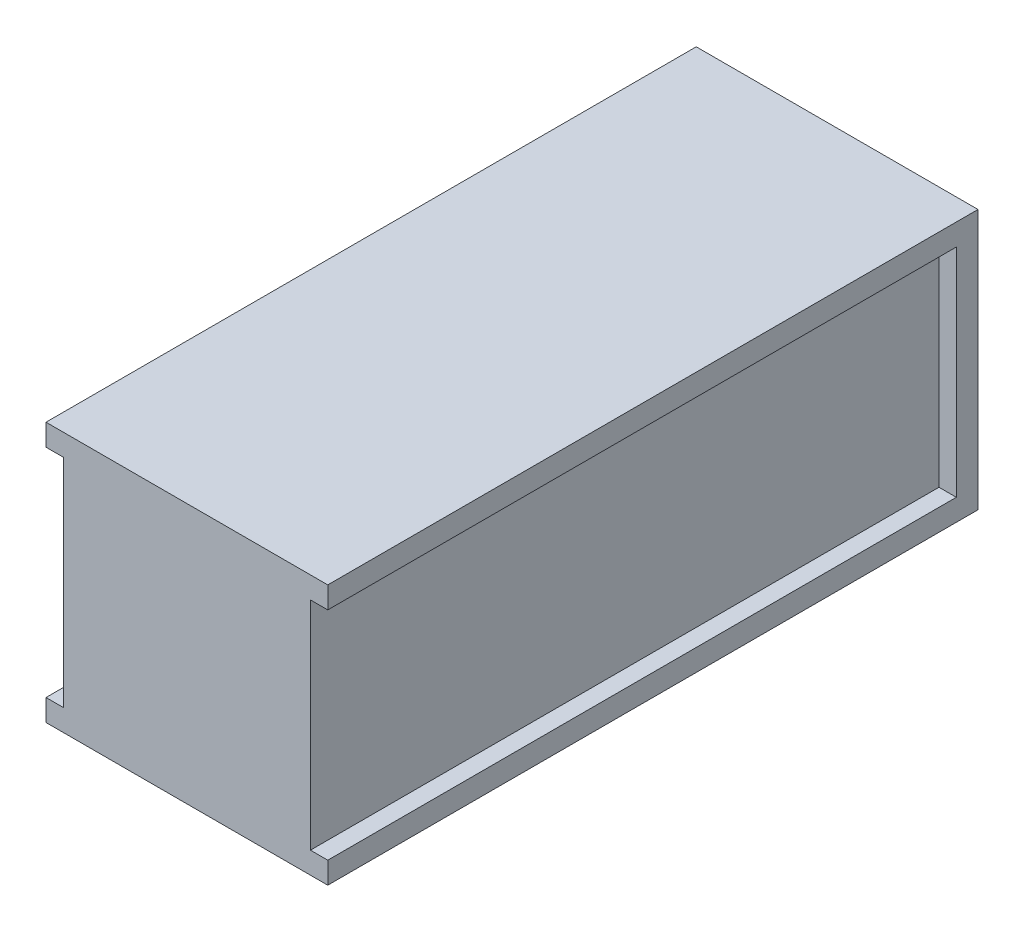
ISO-10303-21;
HEADER;
FILE_DESCRIPTION(('STEP AP214'),'2;1');
FILE_NAME('part.step','',(''),(''),'','','');
FILE_SCHEMA(('AUTOMOTIVE_DESIGN { 1 0 10303 214 1 1 1 1 }'));
ENDSEC;
DATA;
#1=APPLICATION_CONTEXT('core data for automotive mechanical design processes');
#2=APPLICATION_PROTOCOL_DEFINITION('international standard','automotive_design',2000,#1);
#3=PRODUCT_CONTEXT('',#1,'mechanical');
#4=PRODUCT('Part','Part','',(#3));
#5=PRODUCT_RELATED_PRODUCT_CATEGORY('part','',(#4));
#6=PRODUCT_DEFINITION_FORMATION('','',#4);
#7=PRODUCT_DEFINITION_CONTEXT('part definition',#1,'design');
#8=PRODUCT_DEFINITION('design','',#6,#7);
#9=PRODUCT_DEFINITION_SHAPE('','',#8);
#10=(LENGTH_UNIT() NAMED_UNIT(*) SI_UNIT(.MILLI.,.METRE.));
#11=(NAMED_UNIT(*) PLANE_ANGLE_UNIT() SI_UNIT($,.RADIAN.));
#12=(NAMED_UNIT(*) SI_UNIT($,.STERADIAN.) SOLID_ANGLE_UNIT());
#13=UNCERTAINTY_MEASURE_WITH_UNIT(LENGTH_MEASURE(1.E-05),#10,'distance_accuracy_value','');
#14=(GEOMETRIC_REPRESENTATION_CONTEXT(3) GLOBAL_UNCERTAINTY_ASSIGNED_CONTEXT((#13)) GLOBAL_UNIT_ASSIGNED_CONTEXT((#10,
#11,#12)) REPRESENTATION_CONTEXT('',''));
#15=CARTESIAN_POINT('',(0.,0.,0.));
#16=DIRECTION('',(0.,0.,1.));
#17=DIRECTION('',(1.,0.,0.));
#18=AXIS2_PLACEMENT_3D('',#15,#16,#17);
#19=CARTESIAN_POINT('',(-32.5,60.,75.));
#20=DIRECTION('',(0.,0.,-1.));
#21=DIRECTION('',(-1.,0.,0.));
#22=AXIS2_PLACEMENT_3D('',#19,#20,#21);
#23=PLANE('',#22);
#24=DIRECTION('',(1.,0.,0.));
#25=VECTOR('',#24,1.);
#26=CARTESIAN_POINT('',(28.5,55.,75.));
#27=LINE('',#26,#25);
#28=CARTESIAN_POINT('',(28.5,55.,75.));
#29=VERTEX_POINT('',#28);
#30=CARTESIAN_POINT('',(32.5,55.,75.));
#31=VERTEX_POINT('',#30);
#32=EDGE_CURVE('E163',#29,#31,#27,.T.);
#33=ORIENTED_EDGE('',*,*,#32,.T.);
#34=DIRECTION('',(0.,-1.,0.));
#35=VECTOR('',#34,1.);
#36=CARTESIAN_POINT('',(32.5,60.,75.));
#37=LINE('',#36,#35);
#38=CARTESIAN_POINT('',(32.5,60.,75.));
#39=VERTEX_POINT('',#38);
#40=EDGE_CURVE('E198',#39,#31,#37,.T.);
#41=ORIENTED_EDGE('',*,*,#40,.F.);
#42=DIRECTION('',(1.,0.,0.));
#43=VECTOR('',#42,1.);
#44=CARTESIAN_POINT('',(-32.5,60.,75.));
#45=LINE('',#44,#43);
#46=CARTESIAN_POINT('',(-32.5,60.,75.));
#47=VERTEX_POINT('',#46);
#48=EDGE_CURVE('E179',#47,#39,#45,.T.);
#49=ORIENTED_EDGE('',*,*,#48,.F.);
#50=DIRECTION('',(0.,-1.,0.));
#51=VECTOR('',#50,1.);
#52=CARTESIAN_POINT('',(-32.5,60.,75.));
#53=LINE('',#52,#51);
#54=CARTESIAN_POINT('',(-32.5,55.,75.));
#55=VERTEX_POINT('',#54);
#56=EDGE_CURVE('E11',#47,#55,#53,.T.);
#57=ORIENTED_EDGE('',*,*,#56,.T.);
#58=DIRECTION('',(-1.,0.,0.));
#59=VECTOR('',#58,1.);
#60=CARTESIAN_POINT('',(-28.5,55.,75.));
#61=LINE('',#60,#59);
#62=CARTESIAN_POINT('',(-28.5,55.,75.));
#63=VERTEX_POINT('',#62);
#64=EDGE_CURVE('E158',#63,#55,#61,.T.);
#65=ORIENTED_EDGE('',*,*,#64,.F.);
#66=DIRECTION('',(0.,1.,0.));
#67=VECTOR('',#66,1.);
#68=CARTESIAN_POINT('',(-28.5,55.,75.));
#69=LINE('',#68,#67);
#70=CARTESIAN_POINT('',(-28.5,4.99999999999999,75.));
#71=VERTEX_POINT('',#70);
#72=EDGE_CURVE('E149',#71,#63,#69,.T.);
#73=ORIENTED_EDGE('',*,*,#72,.F.);
#74=DIRECTION('',(-1.,0.,0.));
#75=VECTOR('',#74,1.);
#76=CARTESIAN_POINT('',(-28.5,5.00000000000002,75.));
#77=LINE('',#76,#75);
#78=CARTESIAN_POINT('',(-32.5,5.00000000000002,75.));
#79=VERTEX_POINT('',#78);
#80=EDGE_CURVE('E167',#71,#79,#77,.T.);
#81=ORIENTED_EDGE('',*,*,#80,.T.);
#82=CARTESIAN_POINT('',(-32.5,0.,75.));
#83=VERTEX_POINT('',#82);
#84=EDGE_CURVE('E40',#79,#83,#53,.T.);
#85=ORIENTED_EDGE('',*,*,#84,.T.);
#86=DIRECTION('',(1.,0.,0.));
#87=VECTOR('',#86,1.);
#88=CARTESIAN_POINT('',(-32.5,0.,75.));
#89=LINE('',#88,#87);
#90=CARTESIAN_POINT('',(32.5,0.,75.));
#91=VERTEX_POINT('',#90);
#92=EDGE_CURVE('E189',#83,#91,#89,.T.);
#93=ORIENTED_EDGE('',*,*,#92,.T.);
#94=CARTESIAN_POINT('',(32.5,5.,75.));
#95=VERTEX_POINT('',#94);
#96=EDGE_CURVE('E142',#95,#91,#37,.T.);
#97=ORIENTED_EDGE('',*,*,#96,.F.);
#98=DIRECTION('',(1.,0.,0.));
#99=VECTOR('',#98,1.);
#100=CARTESIAN_POINT('',(28.5,5.00000000000002,75.));
#101=LINE('',#100,#99);
#102=CARTESIAN_POINT('',(28.5,5.00000000000002,75.));
#103=VERTEX_POINT('',#102);
#104=EDGE_CURVE('E47',#103,#95,#101,.T.);
#105=ORIENTED_EDGE('',*,*,#104,.F.);
#106=DIRECTION('',(0.,1.,0.));
#107=VECTOR('',#106,1.);
#108=CARTESIAN_POINT('',(28.5,55.,75.));
#109=LINE('',#108,#107);
#110=EDGE_CURVE('E130',#103,#29,#109,.T.);
#111=ORIENTED_EDGE('',*,*,#110,.T.);
#112=EDGE_LOOP('',(#33,#41,#49,#57,#65,#73,#81,#85,#93,#97,#105,#111));
#113=FACE_BOUND('',#112,.T.);
#114=ADVANCED_FACE('F32',(#113),#23,.F.);
#115=CARTESIAN_POINT('',(32.5,60.,-75.));
#116=DIRECTION('',(-1.,0.,0.));
#117=DIRECTION('',(0.,0.,1.));
#118=AXIS2_PLACEMENT_3D('',#115,#116,#117);
#119=PLANE('',#118);
#120=DIRECTION('',(0.,0.,-1.));
#121=VECTOR('',#120,1.);
#122=CARTESIAN_POINT('',(32.5,55.,75.));
#123=LINE('',#122,#121);
#124=CARTESIAN_POINT('',(32.5,55.,-70.));
#125=VERTEX_POINT('',#124);
#126=EDGE_CURVE('E138',#31,#125,#123,.T.);
#127=ORIENTED_EDGE('',*,*,#126,.T.);
#128=DIRECTION('',(0.,-1.,0.));
#129=VECTOR('',#128,1.);
#130=CARTESIAN_POINT('',(32.5,55.,-70.));
#131=LINE('',#130,#129);
#132=CARTESIAN_POINT('',(32.5,4.99999999999999,-70.));
#133=VERTEX_POINT('',#132);
#134=EDGE_CURVE('E229',#125,#133,#131,.T.);
#135=ORIENTED_EDGE('',*,*,#134,.T.);
#136=DIRECTION('',(0.,0.,1.));
#137=VECTOR('',#136,1.);
#138=CARTESIAN_POINT('',(32.5,5.00000000000002,75.));
#139=LINE('',#138,#137);
#140=EDGE_CURVE('E208',#133,#95,#139,.T.);
#141=ORIENTED_EDGE('',*,*,#140,.T.);
#142=ORIENTED_EDGE('',*,*,#96,.T.);
#143=DIRECTION('',(0.,0.,-1.));
#144=VECTOR('',#143,1.);
#145=CARTESIAN_POINT('',(32.5,0.,-75.));
#146=LINE('',#145,#144);
#147=CARTESIAN_POINT('',(32.5,0.,-75.));
#148=VERTEX_POINT('',#147);
#149=EDGE_CURVE('E191',#91,#148,#146,.T.);
#150=ORIENTED_EDGE('',*,*,#149,.T.);
#151=DIRECTION('',(0.,-1.,0.));
#152=VECTOR('',#151,1.);
#153=CARTESIAN_POINT('',(32.5,60.,-75.));
#154=LINE('',#153,#152);
#155=CARTESIAN_POINT('',(32.5,60.,-75.));
#156=VERTEX_POINT('',#155);
#157=EDGE_CURVE('E196',#156,#148,#154,.T.);
#158=ORIENTED_EDGE('',*,*,#157,.F.);
#159=DIRECTION('',(0.,0.,-1.));
#160=VECTOR('',#159,1.);
#161=CARTESIAN_POINT('',(32.5,60.,-75.));
#162=LINE('',#161,#160);
#163=EDGE_CURVE('E182',#39,#156,#162,.T.);
#164=ORIENTED_EDGE('',*,*,#163,.F.);
#165=ORIENTED_EDGE('',*,*,#40,.T.);
#166=EDGE_LOOP('',(#127,#135,#141,#142,#150,#158,#164,#165));
#167=FACE_BOUND('',#166,.T.);
#168=ADVANCED_FACE('F204',(#167),#119,.F.);
#169=CARTESIAN_POINT('',(-32.5,60.,-75.));
#170=DIRECTION('',(1.,0.,0.));
#171=DIRECTION('',(0.,0.,-1.));
#172=AXIS2_PLACEMENT_3D('',#169,#170,#171);
#173=PLANE('',#172);
#174=ORIENTED_EDGE('',*,*,#84,.F.);
#175=DIRECTION('',(0.,0.,1.));
#176=VECTOR('',#175,1.);
#177=CARTESIAN_POINT('',(-32.5,5.00000000000002,75.));
#178=LINE('',#177,#176);
#179=CARTESIAN_POINT('',(-32.5,4.99999999999999,-70.));
#180=VERTEX_POINT('',#179);
#181=EDGE_CURVE('E152',#180,#79,#178,.T.);
#182=ORIENTED_EDGE('',*,*,#181,.F.);
#183=DIRECTION('',(0.,-1.,0.));
#184=VECTOR('',#183,1.);
#185=CARTESIAN_POINT('',(-32.5,55.,-70.));
#186=LINE('',#185,#184);
#187=CARTESIAN_POINT('',(-32.5,55.,-70.));
#188=VERTEX_POINT('',#187);
#189=EDGE_CURVE('E162',#188,#180,#186,.T.);
#190=ORIENTED_EDGE('',*,*,#189,.F.);
#191=DIRECTION('',(0.,0.,-1.));
#192=VECTOR('',#191,1.);
#193=CARTESIAN_POINT('',(-32.5,55.,75.));
#194=LINE('',#193,#192);
#195=EDGE_CURVE('E159',#55,#188,#194,.T.);
#196=ORIENTED_EDGE('',*,*,#195,.F.);
#197=ORIENTED_EDGE('',*,*,#56,.F.);
#198=DIRECTION('',(0.,0.,1.));
#199=VECTOR('',#198,1.);
#200=CARTESIAN_POINT('',(-32.5,60.,-75.));
#201=LINE('',#200,#199);
#202=CARTESIAN_POINT('',(-32.5,60.,-75.));
#203=VERTEX_POINT('',#202);
#204=EDGE_CURVE('E176',#203,#47,#201,.T.);
#205=ORIENTED_EDGE('',*,*,#204,.F.);
#206=DIRECTION('',(0.,-1.,0.));
#207=VECTOR('',#206,1.);
#208=CARTESIAN_POINT('',(-32.5,60.,-75.));
#209=LINE('',#208,#207);
#210=CARTESIAN_POINT('',(-32.5,0.,-75.));
#211=VERTEX_POINT('',#210);
#212=EDGE_CURVE('E186',#203,#211,#209,.T.);
#213=ORIENTED_EDGE('',*,*,#212,.T.);
#214=DIRECTION('',(0.,0.,1.));
#215=VECTOR('',#214,1.);
#216=CARTESIAN_POINT('',(-32.5,0.,-75.));
#217=LINE('',#216,#215);
#218=EDGE_CURVE('E170',#211,#83,#217,.T.);
#219=ORIENTED_EDGE('',*,*,#218,.T.);
#220=EDGE_LOOP('',(#174,#182,#190,#196,#197,#205,#213,#219));
#221=FACE_BOUND('',#220,.T.);
#222=ADVANCED_FACE('F34',(#221),#173,.F.);
#223=CARTESIAN_POINT('',(-32.5,60.,-75.));
#224=DIRECTION('',(0.,0.,1.));
#225=DIRECTION('',(1.,0.,0.));
#226=AXIS2_PLACEMENT_3D('',#223,#224,#225);
#227=PLANE('',#226);
#228=DIRECTION('',(-1.,0.,0.));
#229=VECTOR('',#228,1.);
#230=CARTESIAN_POINT('',(-32.5,0.,-75.));
#231=LINE('',#230,#229);
#232=EDGE_CURVE('E180',#148,#211,#231,.T.);
#233=ORIENTED_EDGE('',*,*,#232,.T.);
#234=ORIENTED_EDGE('',*,*,#212,.F.);
#235=DIRECTION('',(-1.,0.,0.));
#236=VECTOR('',#235,1.);
#237=CARTESIAN_POINT('',(-32.5,60.,-75.));
#238=LINE('',#237,#236);
#239=EDGE_CURVE('E184',#156,#203,#238,.T.);
#240=ORIENTED_EDGE('',*,*,#239,.F.);
#241=ORIENTED_EDGE('',*,*,#157,.T.);
#242=EDGE_LOOP('',(#233,#234,#240,#241));
#243=FACE_BOUND('',#242,.T.);
#244=ADVANCED_FACE('F217',(#243),#227,.F.);
#245=CARTESIAN_POINT('',(0.,60.,0.));
#246=DIRECTION('',(0.,1.,0.));
#247=DIRECTION('',(0.,0.,1.));
#248=AXIS2_PLACEMENT_3D('',#245,#246,#247);
#249=PLANE('',#248);
#250=ORIENTED_EDGE('',*,*,#204,.T.);
#251=ORIENTED_EDGE('',*,*,#48,.T.);
#252=ORIENTED_EDGE('',*,*,#163,.T.);
#253=ORIENTED_EDGE('',*,*,#239,.T.);
#254=EDGE_LOOP('',(#250,#251,#252,#253));
#255=FACE_BOUND('',#254,.T.);
#256=ADVANCED_FACE('F224',(#255),#249,.T.);
#257=CARTESIAN_POINT('',(0.,0.,0.));
#258=DIRECTION('',(0.,1.,0.));
#259=DIRECTION('',(0.,0.,1.));
#260=AXIS2_PLACEMENT_3D('',#257,#258,#259);
#261=PLANE('',#260);
#262=ORIENTED_EDGE('',*,*,#218,.F.);
#263=ORIENTED_EDGE('',*,*,#232,.F.);
#264=ORIENTED_EDGE('',*,*,#149,.F.);
#265=ORIENTED_EDGE('',*,*,#92,.F.);
#266=EDGE_LOOP('',(#262,#263,#264,#265));
#267=FACE_BOUND('',#266,.T.);
#268=ADVANCED_FACE('F214',(#267),#261,.F.);
#269=CARTESIAN_POINT('',(-28.5,5.00000000000002,75.));
#270=DIRECTION('',(0.,-1.,0.));
#271=DIRECTION('',(0.,0.,-1.));
#272=AXIS2_PLACEMENT_3D('',#269,#270,#271);
#273=PLANE('',#272);
#274=ORIENTED_EDGE('',*,*,#181,.T.);
#275=ORIENTED_EDGE('',*,*,#80,.F.);
#276=DIRECTION('',(0.,0.,1.));
#277=VECTOR('',#276,1.);
#278=CARTESIAN_POINT('',(-28.5,5.00000000000002,75.));
#279=LINE('',#278,#277);
#280=CARTESIAN_POINT('',(-28.5,4.99999999999999,-70.));
#281=VERTEX_POINT('',#280);
#282=EDGE_CURVE('E55',#281,#71,#279,.T.);
#283=ORIENTED_EDGE('',*,*,#282,.F.);
#284=DIRECTION('',(-1.,0.,0.));
#285=VECTOR('',#284,1.);
#286=CARTESIAN_POINT('',(-28.5,4.99999999999999,-70.));
#287=LINE('',#286,#285);
#288=EDGE_CURVE('E171',#281,#180,#287,.T.);
#289=ORIENTED_EDGE('',*,*,#288,.T.);
#290=EDGE_LOOP('',(#274,#275,#283,#289));
#291=FACE_BOUND('',#290,.T.);
#292=ADVANCED_FACE('F258',(#291),#273,.F.);
#293=CARTESIAN_POINT('',(-28.5,55.,-70.));
#294=DIRECTION('',(0.,0.,-1.));
#295=DIRECTION('',(-1.,0.,0.));
#296=AXIS2_PLACEMENT_3D('',#293,#294,#295);
#297=PLANE('',#296);
#298=ORIENTED_EDGE('',*,*,#189,.T.);
#299=ORIENTED_EDGE('',*,*,#288,.F.);
#300=DIRECTION('',(0.,-1.,0.));
#301=VECTOR('',#300,1.);
#302=CARTESIAN_POINT('',(-28.5,55.,-70.));
#303=LINE('',#302,#301);
#304=CARTESIAN_POINT('',(-28.5,55.,-70.));
#305=VERTEX_POINT('',#304);
#306=EDGE_CURVE('E155',#305,#281,#303,.T.);
#307=ORIENTED_EDGE('',*,*,#306,.F.);
#308=DIRECTION('',(-1.,0.,0.));
#309=VECTOR('',#308,1.);
#310=CARTESIAN_POINT('',(-28.5,55.,-70.));
#311=LINE('',#310,#309);
#312=EDGE_CURVE('E173',#305,#188,#311,.T.);
#313=ORIENTED_EDGE('',*,*,#312,.T.);
#314=EDGE_LOOP('',(#298,#299,#307,#313));
#315=FACE_BOUND('',#314,.T.);
#316=ADVANCED_FACE('F263',(#315),#297,.F.);
#317=CARTESIAN_POINT('',(-28.5,55.,75.));
#318=DIRECTION('',(0.,1.,0.));
#319=DIRECTION('',(0.,0.,1.));
#320=AXIS2_PLACEMENT_3D('',#317,#318,#319);
#321=PLANE('',#320);
#322=ORIENTED_EDGE('',*,*,#195,.T.);
#323=ORIENTED_EDGE('',*,*,#312,.F.);
#324=DIRECTION('',(0.,0.,-1.));
#325=VECTOR('',#324,1.);
#326=CARTESIAN_POINT('',(-28.5,55.,75.));
#327=LINE('',#326,#325);
#328=EDGE_CURVE('E151',#63,#305,#327,.T.);
#329=ORIENTED_EDGE('',*,*,#328,.F.);
#330=ORIENTED_EDGE('',*,*,#64,.T.);
#331=EDGE_LOOP('',(#322,#323,#329,#330));
#332=FACE_BOUND('',#331,.T.);
#333=ADVANCED_FACE('F245',(#332),#321,.F.);
#334=CARTESIAN_POINT('',(-28.5,0.,0.));
#335=DIRECTION('',(1.,0.,0.));
#336=DIRECTION('',(0.,0.,-1.));
#337=AXIS2_PLACEMENT_3D('',#334,#335,#336);
#338=PLANE('',#337);
#339=ORIENTED_EDGE('',*,*,#72,.T.);
#340=ORIENTED_EDGE('',*,*,#328,.T.);
#341=ORIENTED_EDGE('',*,*,#306,.T.);
#342=ORIENTED_EDGE('',*,*,#282,.T.);
#343=EDGE_LOOP('',(#339,#340,#341,#342));
#344=FACE_BOUND('',#343,.T.);
#345=ADVANCED_FACE('F238',(#344),#338,.F.);
#346=CARTESIAN_POINT('',(28.5,55.,75.));
#347=DIRECTION('',(0.,-1.,0.));
#348=DIRECTION('',(0.,0.,-1.));
#349=AXIS2_PLACEMENT_3D('',#346,#347,#348);
#350=PLANE('',#349);
#351=ORIENTED_EDGE('',*,*,#126,.F.);
#352=ORIENTED_EDGE('',*,*,#32,.F.);
#353=DIRECTION('',(0.,0.,-1.));
#354=VECTOR('',#353,1.);
#355=CARTESIAN_POINT('',(28.5,55.,75.));
#356=LINE('',#355,#354);
#357=CARTESIAN_POINT('',(28.5,55.,-70.));
#358=VERTEX_POINT('',#357);
#359=EDGE_CURVE('E134',#29,#358,#356,.T.);
#360=ORIENTED_EDGE('',*,*,#359,.T.);
#361=DIRECTION('',(1.,0.,0.));
#362=VECTOR('',#361,1.);
#363=CARTESIAN_POINT('',(28.5,55.,-70.));
#364=LINE('',#363,#362);
#365=EDGE_CURVE('E144',#358,#125,#364,.T.);
#366=ORIENTED_EDGE('',*,*,#365,.T.);
#367=EDGE_LOOP('',(#351,#352,#360,#366));
#368=FACE_BOUND('',#367,.T.);
#369=ADVANCED_FACE('F236',(#368),#350,.T.);
#370=CARTESIAN_POINT('',(28.5,55.,-70.));
#371=DIRECTION('',(0.,0.,1.));
#372=DIRECTION('',(1.,0.,0.));
#373=AXIS2_PLACEMENT_3D('',#370,#371,#372);
#374=PLANE('',#373);
#375=ORIENTED_EDGE('',*,*,#134,.F.);
#376=ORIENTED_EDGE('',*,*,#365,.F.);
#377=DIRECTION('',(0.,-1.,0.));
#378=VECTOR('',#377,1.);
#379=CARTESIAN_POINT('',(28.5,55.,-70.));
#380=LINE('',#379,#378);
#381=CARTESIAN_POINT('',(28.5,4.99999999999999,-70.));
#382=VERTEX_POINT('',#381);
#383=EDGE_CURVE('E129',#358,#382,#380,.T.);
#384=ORIENTED_EDGE('',*,*,#383,.T.);
#385=DIRECTION('',(1.,0.,0.));
#386=VECTOR('',#385,1.);
#387=CARTESIAN_POINT('',(28.5,4.99999999999999,-70.));
#388=LINE('',#387,#386);
#389=EDGE_CURVE('E126',#382,#133,#388,.T.);
#390=ORIENTED_EDGE('',*,*,#389,.T.);
#391=EDGE_LOOP('',(#375,#376,#384,#390));
#392=FACE_BOUND('',#391,.T.);
#393=ADVANCED_FACE('F235',(#392),#374,.T.);
#394=CARTESIAN_POINT('',(28.5,5.00000000000002,75.));
#395=DIRECTION('',(0.,1.,0.));
#396=DIRECTION('',(0.,0.,1.));
#397=AXIS2_PLACEMENT_3D('',#394,#395,#396);
#398=PLANE('',#397);
#399=ORIENTED_EDGE('',*,*,#140,.F.);
#400=ORIENTED_EDGE('',*,*,#389,.F.);
#401=DIRECTION('',(0.,0.,1.));
#402=VECTOR('',#401,1.);
#403=CARTESIAN_POINT('',(28.5,5.00000000000002,75.));
#404=LINE('',#403,#402);
#405=EDGE_CURVE('E123',#382,#103,#404,.T.);
#406=ORIENTED_EDGE('',*,*,#405,.T.);
#407=ORIENTED_EDGE('',*,*,#104,.T.);
#408=EDGE_LOOP('',(#399,#400,#406,#407));
#409=FACE_BOUND('',#408,.T.);
#410=ADVANCED_FACE('F125',(#409),#398,.T.);
#411=CARTESIAN_POINT('',(28.5,0.,0.));
#412=DIRECTION('',(-1.,0.,0.));
#413=DIRECTION('',(0.,0.,-1.));
#414=AXIS2_PLACEMENT_3D('',#411,#412,#413);
#415=PLANE('',#414);
#416=ORIENTED_EDGE('',*,*,#110,.F.);
#417=ORIENTED_EDGE('',*,*,#405,.F.);
#418=ORIENTED_EDGE('',*,*,#383,.F.);
#419=ORIENTED_EDGE('',*,*,#359,.F.);
#420=EDGE_LOOP('',(#416,#417,#418,#419));
#421=FACE_BOUND('',#420,.T.);
#422=ADVANCED_FACE('F133',(#421),#415,.F.);
#423=CLOSED_SHELL('',(#114,#168,#222,#244,#256,#268,#292,#316,#333,#345,#369,#393,#410,#422));
#424=MANIFOLD_SOLID_BREP('B2',#423);
#425=ADVANCED_BREP_SHAPE_REPRESENTATION('',(#18,#424),#14);
#426=SHAPE_DEFINITION_REPRESENTATION(#9,#425);
ENDSEC;
END-ISO-10303-21;
